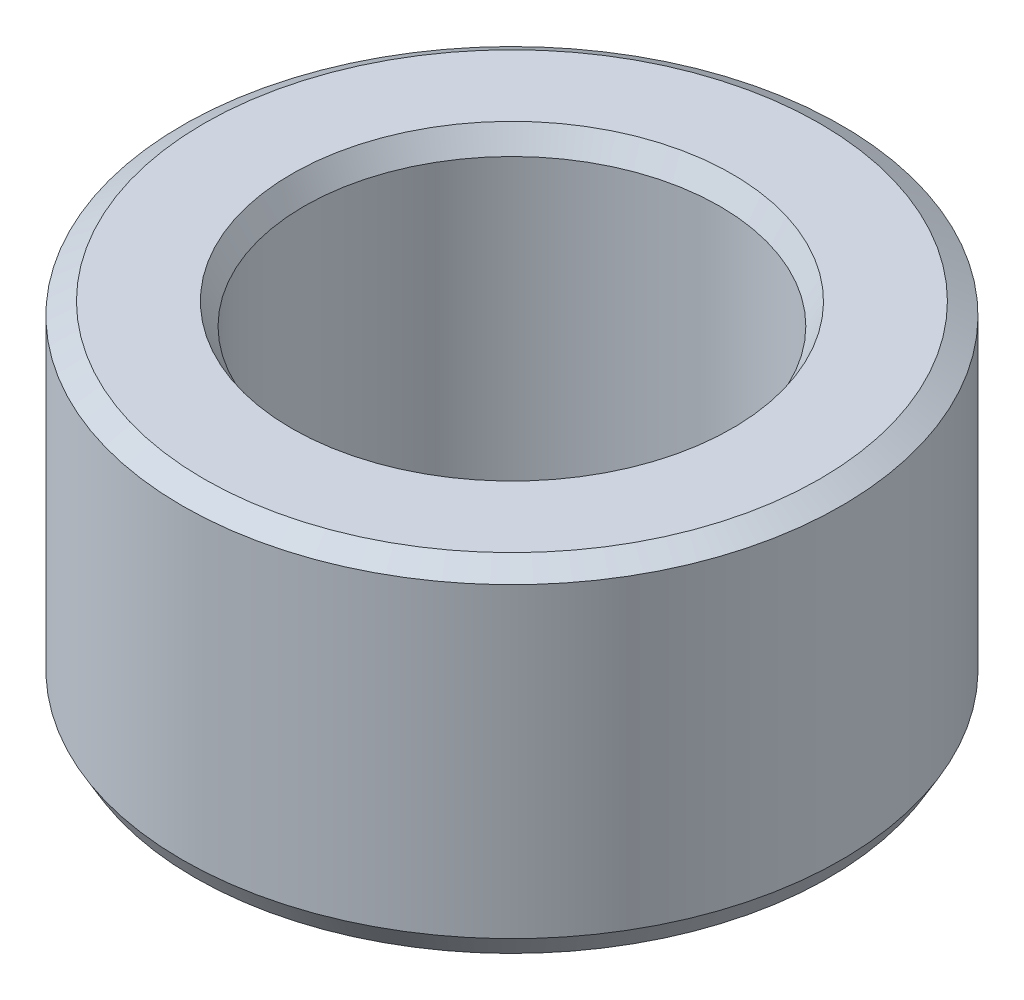
ISO-10303-21;
HEADER;
FILE_DESCRIPTION(('STEP AP214'),'2;1');
FILE_NAME('part.step','',(''),(''),'','','');
FILE_SCHEMA(('AUTOMOTIVE_DESIGN { 1 0 10303 214 1 1 1 1 }'));
ENDSEC;
DATA;
#1=APPLICATION_CONTEXT('core data for automotive mechanical design processes');
#2=APPLICATION_PROTOCOL_DEFINITION('international standard','automotive_design',2000,#1);
#3=PRODUCT_CONTEXT('',#1,'mechanical');
#4=PRODUCT('Part','Part','',(#3));
#5=PRODUCT_RELATED_PRODUCT_CATEGORY('part','',(#4));
#6=PRODUCT_DEFINITION_FORMATION('','',#4);
#7=PRODUCT_DEFINITION_CONTEXT('part definition',#1,'design');
#8=PRODUCT_DEFINITION('design','',#6,#7);
#9=PRODUCT_DEFINITION_SHAPE('','',#8);
#10=(LENGTH_UNIT() NAMED_UNIT(*) SI_UNIT(.MILLI.,.METRE.));
#11=(NAMED_UNIT(*) PLANE_ANGLE_UNIT() SI_UNIT($,.RADIAN.));
#12=(NAMED_UNIT(*) SI_UNIT($,.STERADIAN.) SOLID_ANGLE_UNIT());
#13=UNCERTAINTY_MEASURE_WITH_UNIT(LENGTH_MEASURE(1.E-05),#10,'distance_accuracy_value','');
#14=(GEOMETRIC_REPRESENTATION_CONTEXT(3) GLOBAL_UNCERTAINTY_ASSIGNED_CONTEXT((#13)) GLOBAL_UNIT_ASSIGNED_CONTEXT((#10,
#11,#12)) REPRESENTATION_CONTEXT('',''));
#15=CARTESIAN_POINT('',(0.,0.,0.));
#16=DIRECTION('',(0.,0.,1.));
#17=DIRECTION('',(1.,0.,0.));
#18=AXIS2_PLACEMENT_3D('',#15,#16,#17);
#19=CARTESIAN_POINT('',(0.,20.6732480926008,0.));
#20=DIRECTION('',(0.,-1.,0.));
#21=DIRECTION('',(0.,0.,-1.));
#22=AXIS2_PLACEMENT_3D('',#19,#20,#21);
#23=CYLINDRICAL_SURFACE('',#22,20.);
#24=CARTESIAN_POINT('',(0.,1.31229961626984,0.));
#25=DIRECTION('',(0.,1.,0.));
#26=DIRECTION('',(0.,0.,1.));
#27=AXIS2_PLACEMENT_3D('',#24,#25,#26);
#28=CIRCLE('',#27,20.);
#29=CARTESIAN_POINT('',(0.,1.31229961626984,20.));
#30=VERTEX_POINT('',#29);
#31=EDGE_CURVE('E10',#30,#30,#28,.T.);
#32=ORIENTED_EDGE('',*,*,#31,.T.);
#33=EDGE_LOOP('',(#32));
#34=FACE_BOUND('',#33,.T.);
#35=CARTESIAN_POINT('',(0.,19.91559155589,0.));
#36=DIRECTION('',(0.,1.,0.));
#37=DIRECTION('',(0.,0.,1.));
#38=AXIS2_PLACEMENT_3D('',#35,#36,#37);
#39=CIRCLE('',#38,20.);
#40=CARTESIAN_POINT('',(0.,19.91559155589,20.));
#41=VERTEX_POINT('',#40);
#42=EDGE_CURVE('E50',#41,#41,#39,.F.);
#43=ORIENTED_EDGE('',*,*,#42,.T.);
#44=EDGE_LOOP('',(#43));
#45=FACE_BOUND('',#44,.T.);
#46=ADVANCED_FACE('F39',(#34,#45),#23,.T.);
#47=CARTESIAN_POINT('',(0.,20.6732480926008,0.));
#48=DIRECTION('',(0.,1.,0.));
#49=DIRECTION('',(0.,0.,1.));
#50=AXIS2_PLACEMENT_3D('',#47,#48,#49);
#51=PLANE('',#50);
#52=CARTESIAN_POINT('',(0.,20.6732480926008,0.));
#53=DIRECTION('',(0.,1.,0.));
#54=DIRECTION('',(0.,0.,1.));
#55=AXIS2_PLACEMENT_3D('',#52,#53,#54);
#56=CIRCLE('',#55,13.3700061314623);
#57=CARTESIAN_POINT('',(0.,20.6732480926008,13.3700061314623));
#58=VERTEX_POINT('',#57);
#59=EDGE_CURVE('E58',#58,#58,#56,.F.);
#60=ORIENTED_EDGE('',*,*,#59,.T.);
#61=EDGE_LOOP('',(#60));
#62=FACE_BOUND('',#61,.T.);
#63=CARTESIAN_POINT('',(0.,20.6732480926008,0.));
#64=DIRECTION('',(0.,1.,0.));
#65=DIRECTION('',(0.,0.,1.));
#66=AXIS2_PLACEMENT_3D('',#63,#64,#65);
#67=CIRCLE('',#66,18.6877003837301);
#68=CARTESIAN_POINT('',(0.,20.6732480926008,18.6877003837301));
#69=VERTEX_POINT('',#68);
#70=EDGE_CURVE('E61',#69,#69,#67,.T.);
#71=ORIENTED_EDGE('',*,*,#70,.T.);
#72=EDGE_LOOP('',(#71));
#73=FACE_BOUND('',#72,.T.);
#74=ADVANCED_FACE('F88',(#62,#73),#51,.T.);
#75=CARTESIAN_POINT('',(0.,0.,0.));
#76=DIRECTION('',(0.,1.,0.));
#77=DIRECTION('',(0.,0.,1.));
#78=AXIS2_PLACEMENT_3D('',#75,#76,#77);
#79=PLANE('',#78);
#80=CARTESIAN_POINT('',(0.,0.,0.));
#81=DIRECTION('',(0.,1.,0.));
#82=DIRECTION('',(0.,0.,1.));
#83=AXIS2_PLACEMENT_3D('',#80,#81,#82);
#84=CIRCLE('',#83,13.9246492110214);
#85=CARTESIAN_POINT('',(0.,0.,-13.9246492110214));
#86=VERTEX_POINT('',#85);
#87=EDGE_CURVE('E51',#86,#86,#84,.T.);
#88=ORIENTED_EDGE('',*,*,#87,.T.);
#89=EDGE_LOOP('',(#88));
#90=FACE_BOUND('',#89,.T.);
#91=CARTESIAN_POINT('',(0.,0.,0.));
#92=DIRECTION('',(0.,1.,0.));
#93=DIRECTION('',(0.,0.,1.));
#94=AXIS2_PLACEMENT_3D('',#91,#92,#93);
#95=CIRCLE('',#94,19.2423434632892);
#96=CARTESIAN_POINT('',(0.,0.,19.2423434632892));
#97=VERTEX_POINT('',#96);
#98=EDGE_CURVE('E54',#97,#97,#95,.F.);
#99=ORIENTED_EDGE('',*,*,#98,.T.);
#100=EDGE_LOOP('',(#99));
#101=FACE_BOUND('',#100,.T.);
#102=ADVANCED_FACE('F83',(#90,#101),#79,.F.);
#103=CARTESIAN_POINT('',(0.,20.6732480926008,0.));
#104=DIRECTION('',(0.,-1.,0.));
#105=DIRECTION('',(0.,0.,-1.));
#106=AXIS2_PLACEMENT_3D('',#103,#104,#105);
#107=CYLINDRICAL_SURFACE('',#106,12.6123495947515);
#108=CARTESIAN_POINT('',(0.,19.360948476331,0.));
#109=DIRECTION('',(0.,1.,0.));
#110=DIRECTION('',(0.,0.,1.));
#111=AXIS2_PLACEMENT_3D('',#108,#109,#110);
#112=CIRCLE('',#111,12.6123495947515);
#113=CARTESIAN_POINT('',(0.,19.360948476331,12.6123495947515));
#114=VERTEX_POINT('',#113);
#115=EDGE_CURVE('E67',#114,#114,#112,.T.);
#116=ORIENTED_EDGE('',*,*,#115,.T.);
#117=EDGE_LOOP('',(#116));
#118=FACE_BOUND('',#117,.T.);
#119=CARTESIAN_POINT('',(0.,0.757656536710841,0.));
#120=DIRECTION('',(0.,1.,0.));
#121=DIRECTION('',(0.,0.,1.));
#122=AXIS2_PLACEMENT_3D('',#119,#120,#121);
#123=CIRCLE('',#122,12.6123495947515);
#124=CARTESIAN_POINT('',(0.,0.757656536710841,-12.6123495947515));
#125=VERTEX_POINT('',#124);
#126=EDGE_CURVE('E69',#125,#125,#123,.F.);
#127=ORIENTED_EDGE('',*,*,#126,.T.);
#128=EDGE_LOOP('',(#127));
#129=FACE_BOUND('',#128,.T.);
#130=ADVANCED_FACE('F71',(#118,#129),#107,.F.);
#131=CARTESIAN_POINT('',(0.,19.360948476331,0.));
#132=DIRECTION('',(0.,1.,0.));
#133=DIRECTION('',(0.,0.,1.));
#134=AXIS2_PLACEMENT_3D('',#131,#132,#133);
#135=CONICAL_SURFACE('',#134,12.6123495947515,0.523598775598303);
#136=ORIENTED_EDGE('',*,*,#59,.F.);
#137=EDGE_LOOP('',(#136));
#138=FACE_BOUND('',#137,.T.);
#139=ORIENTED_EDGE('',*,*,#115,.F.);
#140=EDGE_LOOP('',(#139));
#141=FACE_BOUND('',#140,.T.);
#142=ADVANCED_FACE('F77',(#138,#141),#135,.F.);
#143=CARTESIAN_POINT('',(0.,0.,0.));
#144=DIRECTION('',(0.,-1.,0.));
#145=DIRECTION('',(0.,0.,-1.));
#146=AXIS2_PLACEMENT_3D('',#143,#144,#145);
#147=CONICAL_SURFACE('',#146,13.9246492110214,1.04719755119659);
#148=CARTESIAN_POINT('',(0.,0.757656536710841,-12.6123495947515));
#149=CARTESIAN_POINT('',(0.,0.749764281120104,-12.626019382421));
#150=CARTESIAN_POINT('',(0.,0.741872025529365,-12.6396891700905));
#151=CARTESIAN_POINT('',(0.,0.726087514347889,-12.6670287454294));
#152=CARTESIAN_POINT('',(0.,0.718195258757151,-12.6806985330989));
#153=CARTESIAN_POINT('',(0.,0.702410747575676,-12.7080381084379));
#154=CARTESIAN_POINT('',(0.,0.694518491984938,-12.7217078961073));
#155=CARTESIAN_POINT('',(0.,0.678733980803462,-12.7490474714463));
#156=CARTESIAN_POINT('',(0.,0.670841725212724,-12.7627172591158));
#157=CARTESIAN_POINT('',(0.,0.655057214031248,-12.7900568344547));
#158=CARTESIAN_POINT('',(0.,0.64716495844051,-12.8037266221242));
#159=CARTESIAN_POINT('',(0.,0.631380447259034,-12.8310661974632));
#160=CARTESIAN_POINT('',(0.,0.623488191668296,-12.8447359851326));
#161=CARTESIAN_POINT('',(0.,0.60770368048682,-12.8720755604716));
#162=CARTESIAN_POINT('',(0.,0.599811424896083,-12.8857453481411));
#163=CARTESIAN_POINT('',(0.,0.584026913714607,-12.91308492348));
#164=CARTESIAN_POINT('',(0.,0.576134658123869,-12.9267547111495));
#165=CARTESIAN_POINT('',(0.,0.560350146942393,-12.9540942864885));
#166=CARTESIAN_POINT('',(0.,0.552457891351655,-12.9677640741579));
#167=CARTESIAN_POINT('',(0.,0.536673380170179,-12.9951036494969));
#168=CARTESIAN_POINT('',(0.,0.528781124579441,-13.0087734371664));
#169=CARTESIAN_POINT('',(0.,0.512996613397965,-13.0361130125053));
#170=CARTESIAN_POINT('',(0.,0.505104357807227,-13.0497828001748));
#171=CARTESIAN_POINT('',(0.,0.489319846625752,-13.0771223755138));
#172=CARTESIAN_POINT('',(0.,0.481427591035014,-13.0907921631832));
#173=CARTESIAN_POINT('',(0.,0.465643079853538,-13.1181317385222));
#174=CARTESIAN_POINT('',(0.,0.4577508242628,-13.1318015261917));
#175=CARTESIAN_POINT('',(0.,0.441966313081324,-13.1591411015306));
#176=CARTESIAN_POINT('',(0.,0.434074057490586,-13.1728108892001));
#177=CARTESIAN_POINT('',(0.,0.41828954630911,-13.200150464539));
#178=CARTESIAN_POINT('',(0.,0.410397290718372,-13.2138202522085));
#179=CARTESIAN_POINT('',(0.,0.394612779536896,-13.2411598275475));
#180=CARTESIAN_POINT('',(0.,0.386720523946158,-13.254829615217));
#181=CARTESIAN_POINT('',(0.,0.370936012764683,-13.2821691905559));
#182=CARTESIAN_POINT('',(0.,0.363043757173945,-13.2958389782254));
#183=CARTESIAN_POINT('',(0.,0.347259245992469,-13.3231785535643));
#184=CARTESIAN_POINT('',(0.,0.339366990401731,-13.3368483412338));
#185=CARTESIAN_POINT('',(0.,0.323582479220255,-13.3641879165728));
#186=CARTESIAN_POINT('',(0.,0.315690223629517,-13.3778577042423));
#187=CARTESIAN_POINT('',(0.,0.299905712448041,-13.4051972795812));
#188=CARTESIAN_POINT('',(0.,0.292013456857303,-13.4188670672507));
#189=CARTESIAN_POINT('',(0.,0.276228945675827,-13.4462066425896));
#190=CARTESIAN_POINT('',(0.,0.26833669008509,-13.4598764302591));
#191=CARTESIAN_POINT('',(0.,0.252552178903614,-13.4872160055981));
#192=CARTESIAN_POINT('',(0.,0.244659923312876,-13.5008857932676));
#193=CARTESIAN_POINT('',(0.,0.2288754121314,-13.5282253686065));
#194=CARTESIAN_POINT('',(0.,0.220983156540662,-13.541895156276));
#195=CARTESIAN_POINT('',(0.,0.205198645359186,-13.5692347316149));
#196=CARTESIAN_POINT('',(0.,0.197306389768448,-13.5829045192844));
#197=CARTESIAN_POINT('',(0.,0.181521878586972,-13.6102440946234));
#198=CARTESIAN_POINT('',(0.,0.173629622996234,-13.6239138822929));
#199=CARTESIAN_POINT('',(0.,0.157845111814758,-13.6512534576318));
#200=CARTESIAN_POINT('',(0.,0.149952856224021,-13.6649232453013));
#201=CARTESIAN_POINT('',(0.,0.134168345042545,-13.6922628206402));
#202=CARTESIAN_POINT('',(0.,0.126276089451807,-13.7059326083097));
#203=CARTESIAN_POINT('',(0.,0.110491578270331,-13.7332721836487));
#204=CARTESIAN_POINT('',(0.,0.102599322679593,-13.7469419713181));
#205=CARTESIAN_POINT('',(0.,0.0868148114981172,-13.7742815466571));
#206=CARTESIAN_POINT('',(0.,0.0789225559073791,-13.7879513343266));
#207=CARTESIAN_POINT('',(0.,0.0631380447259033,-13.8152909096655));
#208=CARTESIAN_POINT('',(0.,0.0552457891351656,-13.828960697335));
#209=CARTESIAN_POINT('',(0.,0.0394612779536898,-13.856300272674));
#210=CARTESIAN_POINT('',(0.,0.0315690223629518,-13.8699700603434));
#211=CARTESIAN_POINT('',(0.,0.0157845111814758,-13.8973096356824));
#212=CARTESIAN_POINT('',(0.,0.00789225559073775,-13.9109794233519));
#213=CARTESIAN_POINT('',(0.,0.,-13.9246492110214));
#214=B_SPLINE_CURVE_WITH_KNOTS('',3,(#148,#149,#150,#151,#152,#153,#154,#155,#156,#157,#158,
#159,#160,#161,#162,#163,#164,#165,#166,#167,#168,#169,#170,#171,#172,#173,#174,#175,#176,#177,
#178,#179,#180,#181,#182,#183,#184,#185,#186,#187,#188,#189,#190,#191,#192,#193,#194,#195,#196,
#197,#198,#199,#200,#201,#202,#203,#204,#205,#206,#207,#208,#209,#210,#211,#212,#213),
.UNSPECIFIED.,.F.,.F.,(4,2,2,2,2,2,2,2,2,2,2,2,2,2,2,2,2,2,2,2,2,2,2,2,2,2,2,2,2,2,2,2,4),(0.,
0.047353533544427,0.094707067088854,0.142060600633282,0.189414134177709,0.236767667722136,
0.284121201266563,0.331474734810992,0.378828268355419,0.426181801899846,0.473535335444273,
0.5208888689887,0.568242402533128,0.615595936077555,0.662949469621983,0.710303003166409,
0.757656536710837,0.805010070255265,0.852363603799692,0.899717137344119,0.947070670888546,
0.994424204432975,1.0417777379774,1.08913127152183,1.13648480506626,1.18383833861068,
1.23119187215511,1.27854540569954,1.32589893924396,1.37325247278839,1.42060600633282,
1.46795953987725,1.51531307342167),.UNSPECIFIED.);
#215=EDGE_CURVE('BSEAM73',#125,#86,#214,.T.);
#216=ORIENTED_EDGE('',*,*,#126,.F.);
#217=ORIENTED_EDGE('',*,*,#87,.F.);
#218=ORIENTED_EDGE('',*,*,#215,.T.);
#219=ORIENTED_EDGE('',*,*,#215,.F.);
#220=EDGE_LOOP('',(#216,#218,#217,#219));
#221=FACE_BOUND('',#220,.T.);
#222=ADVANCED_FACE('F73',(#221),#147,.F.);
#223=CARTESIAN_POINT('',(0.,1.31229961626984,0.));
#224=DIRECTION('',(0.,1.,0.));
#225=DIRECTION('',(0.,0.,1.));
#226=AXIS2_PLACEMENT_3D('',#223,#224,#225);
#227=CONICAL_SURFACE('',#226,20.,0.523598775598301);
#228=ORIENTED_EDGE('',*,*,#98,.F.);
#229=EDGE_LOOP('',(#228));
#230=FACE_BOUND('',#229,.T.);
#231=ORIENTED_EDGE('',*,*,#31,.F.);
#232=EDGE_LOOP('',(#231));
#233=FACE_BOUND('',#232,.T.);
#234=ADVANCED_FACE('F76',(#230,#233),#227,.T.);
#235=CARTESIAN_POINT('',(0.,20.6732480926008,0.));
#236=DIRECTION('',(0.,-1.,0.));
#237=DIRECTION('',(0.,0.,-1.));
#238=AXIS2_PLACEMENT_3D('',#235,#236,#237);
#239=CONICAL_SURFACE('',#238,18.6877003837301,1.04719755119659);
#240=ORIENTED_EDGE('',*,*,#42,.F.);
#241=EDGE_LOOP('',(#240));
#242=FACE_BOUND('',#241,.T.);
#243=ORIENTED_EDGE('',*,*,#70,.F.);
#244=EDGE_LOOP('',(#243));
#245=FACE_BOUND('',#244,.T.);
#246=ADVANCED_FACE('F45',(#242,#245),#239,.T.);
#247=CLOSED_SHELL('',(#46,#74,#102,#130,#142,#222,#234,#246));
#248=MANIFOLD_SOLID_BREP('B2',#247);
#249=ADVANCED_BREP_SHAPE_REPRESENTATION('',(#18,#248),#14);
#250=SHAPE_DEFINITION_REPRESENTATION(#9,#249);
ENDSEC;
END-ISO-10303-21;
